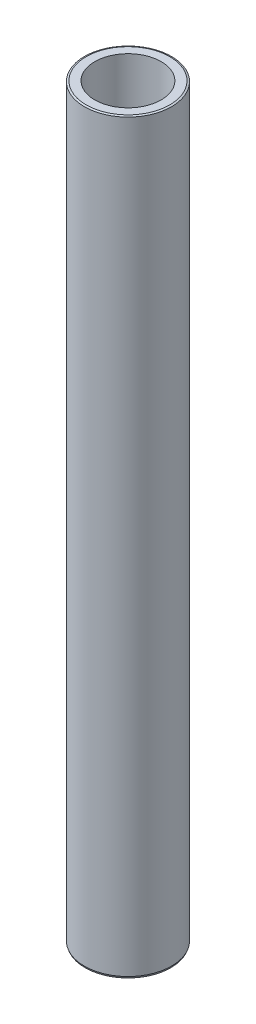
ISO-10303-21;
HEADER;
FILE_DESCRIPTION(('STEP AP214'),'2;1');
FILE_NAME('part.step','',(''),(''),'','','');
FILE_SCHEMA(('AUTOMOTIVE_DESIGN { 1 0 10303 214 1 1 1 1 }'));
ENDSEC;
DATA;
#1=APPLICATION_CONTEXT('core data for automotive mechanical design processes');
#2=APPLICATION_PROTOCOL_DEFINITION('international standard','automotive_design',2000,#1);
#3=PRODUCT_CONTEXT('',#1,'mechanical');
#4=PRODUCT('Part','Part','',(#3));
#5=PRODUCT_RELATED_PRODUCT_CATEGORY('part','',(#4));
#6=PRODUCT_DEFINITION_FORMATION('','',#4);
#7=PRODUCT_DEFINITION_CONTEXT('part definition',#1,'design');
#8=PRODUCT_DEFINITION('design','',#6,#7);
#9=PRODUCT_DEFINITION_SHAPE('','',#8);
#10=(LENGTH_UNIT() NAMED_UNIT(*) SI_UNIT(.MILLI.,.METRE.));
#11=(NAMED_UNIT(*) PLANE_ANGLE_UNIT() SI_UNIT($,.RADIAN.));
#12=(NAMED_UNIT(*) SI_UNIT($,.STERADIAN.) SOLID_ANGLE_UNIT());
#13=UNCERTAINTY_MEASURE_WITH_UNIT(LENGTH_MEASURE(1.E-05),#10,'distance_accuracy_value','');
#14=(GEOMETRIC_REPRESENTATION_CONTEXT(3) GLOBAL_UNCERTAINTY_ASSIGNED_CONTEXT((#13)) GLOBAL_UNIT_ASSIGNED_CONTEXT((#10,
#11,#12)) REPRESENTATION_CONTEXT('',''));
#15=CARTESIAN_POINT('',(0.,0.,0.));
#16=DIRECTION('',(0.,0.,1.));
#17=DIRECTION('',(1.,0.,0.));
#18=AXIS2_PLACEMENT_3D('',#15,#16,#17);
#19=CARTESIAN_POINT('',(0.,600.,0.));
#20=DIRECTION('',(0.,-1.,0.));
#21=DIRECTION('',(0.,0.,-1.));
#22=AXIS2_PLACEMENT_3D('',#19,#20,#21);
#23=CYLINDRICAL_SURFACE('',#22,35.);
#24=CARTESIAN_POINT('',(0.,599.438018760521,0.));
#25=DIRECTION('',(0.,1.,0.));
#26=DIRECTION('',(0.,0.,1.));
#27=AXIS2_PLACEMENT_3D('',#24,#25,#26);
#28=CIRCLE('',#27,35.);
#29=CARTESIAN_POINT('',(0.,599.438018760521,35.));
#30=VERTEX_POINT('',#29);
#31=EDGE_CURVE('E50',#30,#30,#28,.F.);
#32=ORIENTED_EDGE('',*,*,#31,.T.);
#33=EDGE_LOOP('',(#32));
#34=FACE_BOUND('',#33,.T.);
#35=CARTESIAN_POINT('',(0.,1.41903902447627,0.));
#36=DIRECTION('',(0.,1.,0.));
#37=DIRECTION('',(0.,0.,1.));
#38=AXIS2_PLACEMENT_3D('',#35,#36,#37);
#39=CIRCLE('',#38,35.);
#40=CARTESIAN_POINT('',(0.,1.41903902447627,35.));
#41=VERTEX_POINT('',#40);
#42=EDGE_CURVE('E51',#41,#41,#39,.T.);
#43=ORIENTED_EDGE('',*,*,#42,.T.);
#44=EDGE_LOOP('',(#43));
#45=FACE_BOUND('',#44,.T.);
#46=ADVANCED_FACE('F39',(#34,#45),#23,.T.);
#47=CARTESIAN_POINT('',(0.,600.,0.));
#48=DIRECTION('',(0.,1.,0.));
#49=DIRECTION('',(0.,0.,1.));
#50=AXIS2_PLACEMENT_3D('',#47,#48,#49);
#51=PLANE('',#50);
#52=CARTESIAN_POINT('',(0.,600.,0.));
#53=DIRECTION('',(0.,1.,0.));
#54=DIRECTION('',(0.,0.,1.));
#55=AXIS2_PLACEMENT_3D('',#52,#53,#54);
#56=CIRCLE('',#55,33.5809609755245);
#57=CARTESIAN_POINT('',(0.,600.,33.5809609755245));
#58=VERTEX_POINT('',#57);
#59=EDGE_CURVE('E54',#58,#58,#56,.T.);
#60=ORIENTED_EDGE('',*,*,#59,.T.);
#61=EDGE_LOOP('',(#60));
#62=FACE_BOUND('',#61,.T.);
#63=CARTESIAN_POINT('',(0.,600.,0.));
#64=DIRECTION('',(0.,1.,0.));
#65=DIRECTION('',(0.,0.,1.));
#66=AXIS2_PLACEMENT_3D('',#63,#64,#65);
#67=CIRCLE('',#66,26.6832075575412);
#68=CARTESIAN_POINT('',(0.,600.,26.6832075575412));
#69=VERTEX_POINT('',#68);
#70=EDGE_CURVE('E58',#69,#69,#67,.T.);
#71=ORIENTED_EDGE('',*,*,#70,.F.);
#72=EDGE_LOOP('',(#71));
#73=FACE_BOUND('',#72,.T.);
#74=ADVANCED_FACE('F69',(#62,#73),#51,.T.);
#75=CARTESIAN_POINT('',(0.,0.,0.));
#76=DIRECTION('',(0.,1.,0.));
#77=DIRECTION('',(0.,0.,1.));
#78=AXIS2_PLACEMENT_3D('',#75,#76,#77);
#79=PLANE('',#78);
#80=CARTESIAN_POINT('',(0.,0.,0.));
#81=DIRECTION('',(0.,1.,0.));
#82=DIRECTION('',(0.,0.,1.));
#83=AXIS2_PLACEMENT_3D('',#80,#81,#82);
#84=CIRCLE('',#83,34.4380187605207);
#85=CARTESIAN_POINT('',(0.,0.,34.4380187605207));
#86=VERTEX_POINT('',#85);
#87=EDGE_CURVE('E10',#86,#86,#84,.F.);
#88=ORIENTED_EDGE('',*,*,#87,.T.);
#89=EDGE_LOOP('',(#88));
#90=FACE_BOUND('',#89,.T.);
#91=CARTESIAN_POINT('',(0.,0.,0.));
#92=DIRECTION('',(0.,1.,0.));
#93=DIRECTION('',(0.,0.,1.));
#94=AXIS2_PLACEMENT_3D('',#91,#92,#93);
#95=CIRCLE('',#94,26.6832075575412);
#96=CARTESIAN_POINT('',(0.,0.,26.6832075575412));
#97=VERTEX_POINT('',#96);
#98=EDGE_CURVE('E63',#97,#97,#95,.T.);
#99=ORIENTED_EDGE('',*,*,#98,.T.);
#100=EDGE_LOOP('',(#99));
#101=FACE_BOUND('',#100,.T.);
#102=ADVANCED_FACE('F75',(#90,#101),#79,.F.);
#103=CARTESIAN_POINT('',(0.,600.,0.));
#104=DIRECTION('',(0.,-1.,0.));
#105=DIRECTION('',(0.,0.,-1.));
#106=AXIS2_PLACEMENT_3D('',#103,#104,#105);
#107=CYLINDRICAL_SURFACE('',#106,26.6832075575412);
#108=ORIENTED_EDGE('',*,*,#70,.T.);
#109=EDGE_LOOP('',(#108));
#110=FACE_BOUND('',#109,.T.);
#111=ORIENTED_EDGE('',*,*,#98,.F.);
#112=EDGE_LOOP('',(#111));
#113=FACE_BOUND('',#112,.T.);
#114=ADVANCED_FACE('F70',(#110,#113),#107,.F.);
#115=CARTESIAN_POINT('',(0.,600.,0.));
#116=DIRECTION('',(0.,-1.,0.));
#117=DIRECTION('',(0.,0.,-1.));
#118=AXIS2_PLACEMENT_3D('',#115,#116,#117);
#119=CONICAL_SURFACE('',#118,33.5809609755245,1.1937175200735);
#120=ORIENTED_EDGE('',*,*,#31,.F.);
#121=EDGE_LOOP('',(#120));
#122=FACE_BOUND('',#121,.T.);
#123=ORIENTED_EDGE('',*,*,#59,.F.);
#124=EDGE_LOOP('',(#123));
#125=FACE_BOUND('',#124,.T.);
#126=ADVANCED_FACE('F81',(#122,#125),#119,.T.);
#127=CARTESIAN_POINT('',(0.,1.41903902447627,0.));
#128=DIRECTION('',(0.,1.,0.));
#129=DIRECTION('',(0.,0.,1.));
#130=AXIS2_PLACEMENT_3D('',#127,#128,#129);
#131=CONICAL_SURFACE('',#130,35.,0.377078806721415);
#132=CARTESIAN_POINT('',(0.,0.,34.4380187605207));
#133=CARTESIAN_POINT('',(0.,0.0147816565049609,34.4438727317653));
#134=CARTESIAN_POINT('',(0.,0.029563313009922,34.4497267030099));
#135=CARTESIAN_POINT('',(0.,0.0591266260198442,34.461434645499));
#136=CARTESIAN_POINT('',(0.,0.0739082825248053,34.4672886167436));
#137=CARTESIAN_POINT('',(0.,0.103471595534727,34.4789965592328));
#138=CARTESIAN_POINT('',(0.,0.118253252039689,34.4848505304773));
#139=CARTESIAN_POINT('',(0.,0.147816565049611,34.4965584729665));
#140=CARTESIAN_POINT('',(0.,0.162598221554572,34.5024124442111));
#141=CARTESIAN_POINT('',(0.,0.192161534564494,34.5141203867002));
#142=CARTESIAN_POINT('',(0.,0.206943191069455,34.5199743579448));
#143=CARTESIAN_POINT('',(0.,0.236506504079377,34.531682300434));
#144=CARTESIAN_POINT('',(0.,0.251288160584338,34.5375362716785));
#145=CARTESIAN_POINT('',(0.,0.280851473594261,34.5492442141677));
#146=CARTESIAN_POINT('',(0.,0.295633130099222,34.5550981854123));
#147=CARTESIAN_POINT('',(0.,0.325196443109144,34.5668061279014));
#148=CARTESIAN_POINT('',(0.,0.339978099614105,34.572660099146));
#149=CARTESIAN_POINT('',(0.,0.369541412624027,34.5843680416351));
#150=CARTESIAN_POINT('',(0.,0.384323069128988,34.5902220128797));
#151=CARTESIAN_POINT('',(0.,0.41388638213891,34.6019299553689));
#152=CARTESIAN_POINT('',(0.,0.428668038643872,34.6077839266134));
#153=CARTESIAN_POINT('',(0.,0.458231351653794,34.6194918691026));
#154=CARTESIAN_POINT('',(0.,0.473013008158755,34.6253458403472));
#155=CARTESIAN_POINT('',(0.,0.502576321168677,34.6370537828363));
#156=CARTESIAN_POINT('',(0.,0.517357977673638,34.6429077540809));
#157=CARTESIAN_POINT('',(0.,0.54692129068356,34.65461569657));
#158=CARTESIAN_POINT('',(0.,0.561702947188522,34.6604696678146));
#159=CARTESIAN_POINT('',(0.,0.591266260198444,34.6721776103038));
#160=CARTESIAN_POINT('',(0.,0.606047916703405,34.6780315815483));
#161=CARTESIAN_POINT('',(0.,0.635611229713327,34.6897395240375));
#162=CARTESIAN_POINT('',(0.,0.650392886218288,34.6955934952821));
#163=CARTESIAN_POINT('',(0.,0.67995619922821,34.7073014377712));
#164=CARTESIAN_POINT('',(0.,0.694737855733172,34.7131554090158));
#165=CARTESIAN_POINT('',(0.,0.724301168743094,34.724863351505));
#166=CARTESIAN_POINT('',(0.,0.739082825248054,34.7307173227495));
#167=CARTESIAN_POINT('',(0.,0.768646138257976,34.7424252652387));
#168=CARTESIAN_POINT('',(0.,0.783427794762938,34.7482792364833));
#169=CARTESIAN_POINT('',(0.,0.81299110777286,34.7599871789724));
#170=CARTESIAN_POINT('',(0.,0.827772764277821,34.765841150217));
#171=CARTESIAN_POINT('',(0.,0.857336077287743,34.7775490927061));
#172=CARTESIAN_POINT('',(0.,0.872117733792705,34.7834030639507));
#173=CARTESIAN_POINT('',(0.,0.901681046802627,34.7951110064399));
#174=CARTESIAN_POINT('',(0.,0.916462703307588,34.8009649776844));
#175=CARTESIAN_POINT('',(0.,0.94602601631751,34.8126729201736));
#176=CARTESIAN_POINT('',(0.,0.960807672822471,34.8185268914182));
#177=CARTESIAN_POINT('',(0.,0.990370985832393,34.8302348339073));
#178=CARTESIAN_POINT('',(0.,1.00515264233735,34.8360888051519));
#179=CARTESIAN_POINT('',(0.,1.03471595534728,34.847796747641));
#180=CARTESIAN_POINT('',(0.,1.04949761185224,34.8536507188856));
#181=CARTESIAN_POINT('',(0.,1.07906092486216,34.8653586613748));
#182=CARTESIAN_POINT('',(0.,1.09384258136712,34.8712126326193));
#183=CARTESIAN_POINT('',(0.,1.12340589437704,34.8829205751085));
#184=CARTESIAN_POINT('',(0.,1.138187550882,34.8887745463531));
#185=CARTESIAN_POINT('',(0.,1.16775086389193,34.9004824888422));
#186=CARTESIAN_POINT('',(0.,1.18253252039689,34.9063364600868));
#187=CARTESIAN_POINT('',(0.,1.21209583340681,34.918044402576));
#188=CARTESIAN_POINT('',(0.,1.22687748991177,34.9238983738205));
#189=CARTESIAN_POINT('',(0.,1.25644080292169,34.9356063163097));
#190=CARTESIAN_POINT('',(0.,1.27122245942665,34.9414602875542));
#191=CARTESIAN_POINT('',(0.,1.30078577243658,34.9531682300434));
#192=CARTESIAN_POINT('',(0.,1.31556742894154,34.959022201288));
#193=CARTESIAN_POINT('',(0.,1.34513074195146,34.9707301437771));
#194=CARTESIAN_POINT('',(0.,1.35991239845642,34.9765841150217));
#195=CARTESIAN_POINT('',(0.,1.38947571146634,34.9882920575109));
#196=CARTESIAN_POINT('',(0.,1.4042573679713,34.9941460287554));
#197=CARTESIAN_POINT('',(0.,1.41903902447627,35.));
#198=B_SPLINE_CURVE_WITH_KNOTS('',3,(#132,#133,#134,#135,#136,#137,#138,#139,#140,#141,#142,
#143,#144,#145,#146,#147,#148,#149,#150,#151,#152,#153,#154,#155,#156,#157,#158,#159,#160,#161,
#162,#163,#164,#165,#166,#167,#168,#169,#170,#171,#172,#173,#174,#175,#176,#177,#178,#179,#180,
#181,#182,#183,#184,#185,#186,#187,#188,#189,#190,#191,#192,#193,#194,#195,#196,#197),
.UNSPECIFIED.,.F.,.F.,(4,2,2,2,2,2,2,2,2,2,2,2,2,2,2,2,2,2,2,2,2,2,2,2,2,2,2,2,2,2,2,2,4),(0.,
0.0476958817432574,0.0953917634865147,0.143087645229772,0.190783526973029,0.238479408716287,
0.286175290459544,0.333871172202801,0.381567053946059,0.429262935689316,0.476958817432574,
0.524654699175831,0.572350580919088,0.620046462662346,0.667742344405603,0.71543822614886,
0.763134107892118,0.810829989635378,0.858525871378635,0.906221753121892,0.95391763486515,
1.00161351660841,1.04930939835166,1.09700528009492,1.14470116183818,1.19239704358144,
1.24009292532469,1.28778880706795,1.33548468881121,1.38318057055447,1.43087645229772,
1.47857233404098,1.52626821578424),.UNSPECIFIED.);
#199=EDGE_CURVE('BSEAM45',#86,#41,#198,.T.);
#200=ORIENTED_EDGE('',*,*,#87,.F.);
#201=ORIENTED_EDGE('',*,*,#42,.F.);
#202=ORIENTED_EDGE('',*,*,#199,.T.);
#203=ORIENTED_EDGE('',*,*,#199,.F.);
#204=EDGE_LOOP('',(#200,#202,#201,#203));
#205=FACE_BOUND('',#204,.T.);
#206=ADVANCED_FACE('F45',(#205),#131,.T.);
#207=CLOSED_SHELL('',(#46,#74,#102,#114,#126,#206));
#208=MANIFOLD_SOLID_BREP('B2',#207);
#209=ADVANCED_BREP_SHAPE_REPRESENTATION('',(#18,#208),#14);
#210=SHAPE_DEFINITION_REPRESENTATION(#9,#209);
ENDSEC;
END-ISO-10303-21;
